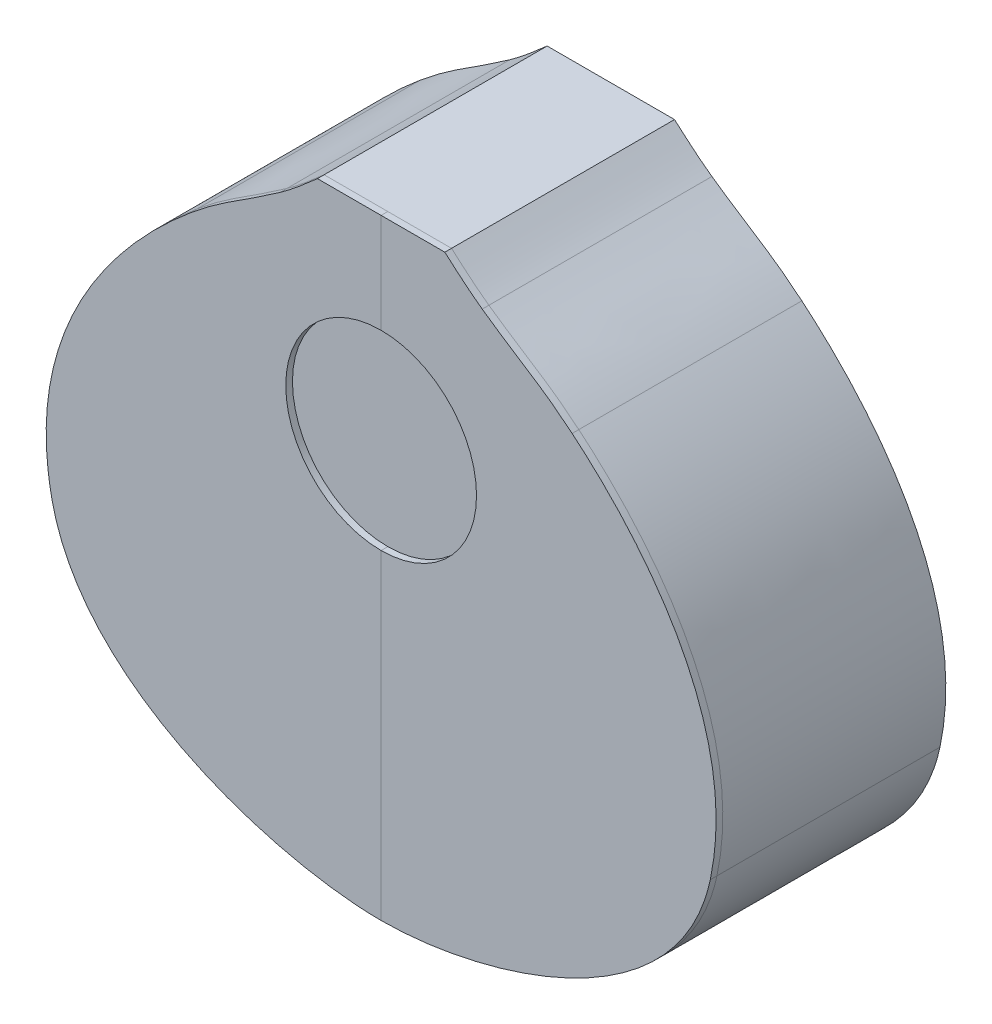
ISO-10303-21;
HEADER;
FILE_DESCRIPTION(('STEP AP214'),'2;1');
FILE_NAME('part.step','',(''),(''),'','','');
FILE_SCHEMA(('AUTOMOTIVE_DESIGN { 1 0 10303 214 1 1 1 1 }'));
ENDSEC;
DATA;
#1=APPLICATION_CONTEXT('core data for automotive mechanical design processes');
#2=APPLICATION_PROTOCOL_DEFINITION('international standard','automotive_design',2000,#1);
#3=PRODUCT_CONTEXT('',#1,'mechanical');
#4=PRODUCT('Part','Part','',(#3));
#5=PRODUCT_RELATED_PRODUCT_CATEGORY('part','',(#4));
#6=PRODUCT_DEFINITION_FORMATION('','',#4);
#7=PRODUCT_DEFINITION_CONTEXT('part definition',#1,'design');
#8=PRODUCT_DEFINITION('design','',#6,#7);
#9=PRODUCT_DEFINITION_SHAPE('','',#8);
#10=(LENGTH_UNIT() NAMED_UNIT(*) SI_UNIT(.MILLI.,.METRE.));
#11=(NAMED_UNIT(*) PLANE_ANGLE_UNIT() SI_UNIT($,.RADIAN.));
#12=(NAMED_UNIT(*) SI_UNIT($,.STERADIAN.) SOLID_ANGLE_UNIT());
#13=UNCERTAINTY_MEASURE_WITH_UNIT(LENGTH_MEASURE(1.E-05),#10,'distance_accuracy_value','');
#14=(GEOMETRIC_REPRESENTATION_CONTEXT(3) GLOBAL_UNCERTAINTY_ASSIGNED_CONTEXT((#13)) GLOBAL_UNIT_ASSIGNED_CONTEXT((#10,
#11,#12)) REPRESENTATION_CONTEXT('',''));
#15=CARTESIAN_POINT('',(0.,0.,0.));
#16=DIRECTION('',(0.,0.,1.));
#17=DIRECTION('',(1.,0.,0.));
#18=AXIS2_PLACEMENT_3D('',#15,#16,#17);
#19=CARTESIAN_POINT('',(28.5608026699999,136.916395712,103.));
#20=DIRECTION('',(0.,-1.,0.));
#21=DIRECTION('',(0.,0.,-1.));
#22=AXIS2_PLACEMENT_3D('',#19,#20,#21);
#23=PLANE('',#22);
#24=DIRECTION('',(-1.,0.,0.));
#25=VECTOR('',#24,1.);
#26=CARTESIAN_POINT('',(28.5608026699999,136.916395712,100.));
#27=LINE('',#26,#25);
#28=CARTESIAN_POINT('',(28.5608026699999,136.916395712,100.));
#29=VERTEX_POINT('',#28);
#30=CARTESIAN_POINT('',(2.54000051894132E-07,136.916395712,100.));
#31=VERTEX_POINT('',#30);
#32=EDGE_CURVE('E215',#29,#31,#27,.T.);
#33=ORIENTED_EDGE('',*,*,#32,.T.);
#34=DIRECTION('',(0.,0.,-1.));
#35=VECTOR('',#34,1.);
#36=CARTESIAN_POINT('',(2.54000051894132E-07,136.916395712,103.));
#37=LINE('',#36,#35);
#38=CARTESIAN_POINT('',(2.54000051894132E-07,136.916395712,103.));
#39=VERTEX_POINT('',#38);
#40=EDGE_CURVE('E12',#39,#31,#37,.T.);
#41=ORIENTED_EDGE('',*,*,#40,.F.);
#42=DIRECTION('',(-1.,0.,0.));
#43=VECTOR('',#42,1.);
#44=CARTESIAN_POINT('',(28.5608026699999,136.916395712,103.));
#45=LINE('',#44,#43);
#46=CARTESIAN_POINT('',(28.5608026699999,136.916395712,103.));
#47=VERTEX_POINT('',#46);
#48=EDGE_CURVE('E176',#47,#39,#45,.T.);
#49=ORIENTED_EDGE('',*,*,#48,.F.);
#50=DIRECTION('',(0.,0.,-1.));
#51=VECTOR('',#50,1.);
#52=CARTESIAN_POINT('',(28.5608026699999,136.916395712,103.));
#53=LINE('',#52,#51);
#54=EDGE_CURVE('E134',#47,#29,#53,.T.);
#55=ORIENTED_EDGE('',*,*,#54,.T.);
#56=EDGE_LOOP('',(#33,#41,#49,#55));
#57=FACE_BOUND('',#56,.T.);
#58=ADVANCED_FACE('F42',(#57),#23,.F.);
#59=CARTESIAN_POINT('',(2.54000051894132E-07,136.916395712,103.));
#60=DIRECTION('',(1.,0.,0.));
#61=DIRECTION('',(0.,0.,-1.));
#62=AXIS2_PLACEMENT_3D('',#59,#60,#61);
#63=PLANE('',#62);
#64=DIRECTION('',(0.,-1.,0.));
#65=VECTOR('',#64,1.);
#66=CARTESIAN_POINT('',(2.54000051894132E-07,136.916395712,100.));
#67=LINE('',#66,#65);
#68=CARTESIAN_POINT('',(2.54000051894132E-07,92.3065453022117,100.));
#69=VERTEX_POINT('',#68);
#70=EDGE_CURVE('E209',#31,#69,#67,.T.);
#71=ORIENTED_EDGE('',*,*,#70,.T.);
#72=DIRECTION('',(0.,0.,-1.));
#73=VECTOR('',#72,1.);
#74=CARTESIAN_POINT('',(2.54000051894132E-07,92.3065453022117,103.));
#75=LINE('',#74,#73);
#76=CARTESIAN_POINT('',(2.54000051894132E-07,92.3065453022117,103.));
#77=VERTEX_POINT('',#76);
#78=EDGE_CURVE('E50',#77,#69,#75,.T.);
#79=ORIENTED_EDGE('',*,*,#78,.F.);
#80=DIRECTION('',(0.,-1.,0.));
#81=VECTOR('',#80,1.);
#82=CARTESIAN_POINT('',(2.54000051894132E-07,136.916395712,103.));
#83=LINE('',#82,#81);
#84=EDGE_CURVE('E101',#39,#77,#83,.T.);
#85=ORIENTED_EDGE('',*,*,#84,.F.);
#86=ORIENTED_EDGE('',*,*,#40,.T.);
#87=EDGE_LOOP('',(#71,#79,#85,#86));
#88=FACE_BOUND('',#87,.T.);
#89=ADVANCED_FACE('F237',(#88),#63,.F.);
#90=CARTESIAN_POINT('',(2.54000051894132E-07,49.5382312132486,103.));
#91=DIRECTION('',(0.,0.,-1.));
#92=DIRECTION('',(-1.,0.,0.));
#93=AXIS2_PLACEMENT_3D('',#90,#91,#92);
#94=CYLINDRICAL_SURFACE('',#93,42.7683140889631);
#95=CARTESIAN_POINT('',(2.54000051894132E-07,49.5382312132486,100.));
#96=DIRECTION('',(0.,0.,-1.));
#97=DIRECTION('',(-1.,0.,0.));
#98=AXIS2_PLACEMENT_3D('',#95,#96,#97);
#99=CIRCLE('',#98,42.7683140889631);
#100=CARTESIAN_POINT('',(2.54000059750544E-07,6.76991712428546,100.));
#101=VERTEX_POINT('',#100);
#102=EDGE_CURVE('E204',#69,#101,#99,.T.);
#103=ORIENTED_EDGE('',*,*,#102,.T.);
#104=DIRECTION('',(0.,0.,-1.));
#105=VECTOR('',#104,1.);
#106=CARTESIAN_POINT('',(2.54000059750544E-07,6.76991712428546,103.));
#107=LINE('',#106,#105);
#108=CARTESIAN_POINT('',(2.54000059750544E-07,6.76991712428546,103.));
#109=VERTEX_POINT('',#108);
#110=EDGE_CURVE('E196',#109,#101,#107,.T.);
#111=ORIENTED_EDGE('',*,*,#110,.F.);
#112=CARTESIAN_POINT('',(2.54000051894132E-07,49.5382312132486,103.));
#113=DIRECTION('',(0.,0.,-1.));
#114=DIRECTION('',(-1.,0.,0.));
#115=AXIS2_PLACEMENT_3D('',#112,#113,#114);
#116=CIRCLE('',#115,42.7683140889631);
#117=EDGE_CURVE('E173',#77,#109,#116,.T.);
#118=ORIENTED_EDGE('',*,*,#117,.F.);
#119=ORIENTED_EDGE('',*,*,#78,.T.);
#120=EDGE_LOOP('',(#103,#111,#118,#119));
#121=FACE_BOUND('',#120,.T.);
#122=ADVANCED_FACE('F202',(#121),#94,.F.);
#123=CARTESIAN_POINT('',(2.54000051894132E-07,6.76991712428546,103.));
#124=DIRECTION('',(1.,0.,0.));
#125=DIRECTION('',(0.,1.,0.));
#126=AXIS2_PLACEMENT_3D('',#123,#124,#125);
#127=PLANE('',#126);
#128=DIRECTION('',(0.,-1.,0.));
#129=VECTOR('',#128,1.);
#130=CARTESIAN_POINT('',(2.54000051894132E-07,6.76991712428546,100.));
#131=LINE('',#130,#129);
#132=CARTESIAN_POINT('',(2.5399994087183E-07,-136.916395712,100.));
#133=VERTEX_POINT('',#132);
#134=EDGE_CURVE('E211',#101,#133,#131,.T.);
#135=ORIENTED_EDGE('',*,*,#134,.T.);
#136=DIRECTION('',(0.,0.,-1.));
#137=VECTOR('',#136,1.);
#138=CARTESIAN_POINT('',(2.5399994087183E-07,-136.916395712,103.));
#139=LINE('',#138,#137);
#140=CARTESIAN_POINT('',(2.5399994087183E-07,-136.916395712,103.));
#141=VERTEX_POINT('',#140);
#142=EDGE_CURVE('E193',#141,#133,#139,.T.);
#143=ORIENTED_EDGE('',*,*,#142,.F.);
#144=DIRECTION('',(0.,-1.,0.));
#145=VECTOR('',#144,1.);
#146=CARTESIAN_POINT('',(2.54000051894132E-07,6.76991712428546,103.));
#147=LINE('',#146,#145);
#148=EDGE_CURVE('E168',#109,#141,#147,.T.);
#149=ORIENTED_EDGE('',*,*,#148,.F.);
#150=ORIENTED_EDGE('',*,*,#110,.T.);
#151=EDGE_LOOP('',(#135,#143,#149,#150));
#152=FACE_BOUND('',#151,.T.);
#153=ADVANCED_FACE('F161',(#152),#127,.F.);
#154=CARTESIAN_POINT('',(2.54000051894132E-07,-136.916395712,103.));
#155=CARTESIAN_POINT('',(46.4413409500002,-136.916395601955,103.));
#156=CARTESIAN_POINT('',(133.833406898179,-111.670406770875,103.));
#157=CARTESIAN_POINT('',(147.578497873594,-47.2764964103053,103.));
#158=B_SPLINE_CURVE_WITH_KNOTS('',3,(#154,#155,#156,#157),.UNSPECIFIED.,.F.,.F.,(4,4),(0.,1.),.UNSPECIFIED.);
#159=DIRECTION('',(0.,0.,-1.));
#160=VECTOR('',#159,1.);
#161=SURFACE_OF_LINEAR_EXTRUSION('',#158,#160);
#162=CARTESIAN_POINT('',(2.54000051894132E-07,-136.916395712,100.));
#163=CARTESIAN_POINT('',(46.4413409500002,-136.916395601955,100.));
#164=CARTESIAN_POINT('',(133.833406898179,-111.670406770875,100.));
#165=CARTESIAN_POINT('',(147.578497873594,-47.2764964103053,100.));
#166=B_SPLINE_CURVE_WITH_KNOTS('',3,(#162,#163,#164,#165),.UNSPECIFIED.,.F.,.F.,(4,4),(0.,1.),.UNSPECIFIED.);
#167=CARTESIAN_POINT('',(147.578497873594,-47.2764964103053,100.));
#168=VERTEX_POINT('',#167);
#169=EDGE_CURVE('E213',#133,#168,#166,.T.);
#170=ORIENTED_EDGE('',*,*,#169,.T.);
#171=DIRECTION('',(0.,0.,-1.));
#172=VECTOR('',#171,1.);
#173=CARTESIAN_POINT('',(147.578497873594,-47.2764964103053,103.));
#174=LINE('',#173,#172);
#175=CARTESIAN_POINT('',(147.578497873594,-47.2764964103053,103.));
#176=VERTEX_POINT('',#175);
#177=EDGE_CURVE('E129',#176,#168,#174,.T.);
#178=ORIENTED_EDGE('',*,*,#177,.F.);
#179=EDGE_CURVE('E120',#141,#176,#158,.T.);
#180=ORIENTED_EDGE('',*,*,#179,.F.);
#181=ORIENTED_EDGE('',*,*,#142,.T.);
#182=EDGE_LOOP('',(#170,#178,#180,#181));
#183=FACE_BOUND('',#182,.T.);
#184=ADVANCED_FACE('F158',(#183),#161,.F.);
#185=CARTESIAN_POINT('',(147.578497873594,-47.2764964103053,103.));
#186=CARTESIAN_POINT('',(163.110193094786,25.4872575653832,103.));
#187=CARTESIAN_POINT('',(105.36071825103,78.5808853673423,103.));
#188=CARTESIAN_POINT('',(85.63939819,95.058759336,103.));
#189=B_SPLINE_CURVE_WITH_KNOTS('',3,(#185,#186,#187,#188),.UNSPECIFIED.,.F.,.F.,(4,4),(0.,1.),.UNSPECIFIED.);
#190=DIRECTION('',(0.,0.,-1.));
#191=VECTOR('',#190,1.);
#192=SURFACE_OF_LINEAR_EXTRUSION('',#189,#191);
#193=CARTESIAN_POINT('',(147.578497873594,-47.2764964103053,100.));
#194=CARTESIAN_POINT('',(163.110193094786,25.4872575653832,100.));
#195=CARTESIAN_POINT('',(105.36071825103,78.5808853673423,100.));
#196=CARTESIAN_POINT('',(85.63939819,95.058759336,100.));
#197=B_SPLINE_CURVE_WITH_KNOTS('',3,(#193,#194,#195,#196),.UNSPECIFIED.,.F.,.F.,(4,4),(0.,1.),.UNSPECIFIED.);
#198=CARTESIAN_POINT('',(85.63939819,95.058759336,100.));
#199=VERTEX_POINT('',#198);
#200=EDGE_CURVE('E128',#168,#199,#197,.T.);
#201=ORIENTED_EDGE('',*,*,#200,.T.);
#202=DIRECTION('',(0.,0.,-1.));
#203=VECTOR('',#202,1.);
#204=CARTESIAN_POINT('',(85.63939819,95.058759336,103.));
#205=LINE('',#204,#203);
#206=CARTESIAN_POINT('',(85.63939819,95.058759336,103.));
#207=VERTEX_POINT('',#206);
#208=EDGE_CURVE('E125',#207,#199,#205,.T.);
#209=ORIENTED_EDGE('',*,*,#208,.F.);
#210=EDGE_CURVE('E114',#176,#207,#189,.T.);
#211=ORIENTED_EDGE('',*,*,#210,.F.);
#212=ORIENTED_EDGE('',*,*,#177,.T.);
#213=EDGE_LOOP('',(#201,#209,#211,#212));
#214=FACE_BOUND('',#213,.T.);
#215=ADVANCED_FACE('F126',(#214),#192,.F.);
#216=CARTESIAN_POINT('',(85.63939819,95.058759336,103.));
#217=CARTESIAN_POINT('',(70.77869639,107.475422336,103.));
#218=CARTESIAN_POINT('',(62.7857664779999,110.83954464,103.));
#219=CARTESIAN_POINT('',(45.323206534,123.188624336,103.));
#220=B_SPLINE_CURVE_WITH_KNOTS('',3,(#216,#217,#218,#219),.UNSPECIFIED.,.F.,.F.,(4,4),(0.,1.),.UNSPECIFIED.);
#221=DIRECTION('',(0.,0.,-1.));
#222=VECTOR('',#221,1.);
#223=SURFACE_OF_LINEAR_EXTRUSION('',#220,#222);
#224=CARTESIAN_POINT('',(85.63939819,95.058759336,100.));
#225=CARTESIAN_POINT('',(70.77869639,107.475422336,100.));
#226=CARTESIAN_POINT('',(62.7857664779999,110.83954464,100.));
#227=CARTESIAN_POINT('',(45.323206534,123.188624336,100.));
#228=B_SPLINE_CURVE_WITH_KNOTS('',3,(#224,#225,#226,#227),.UNSPECIFIED.,.F.,.F.,(4,4),(0.,1.),.UNSPECIFIED.);
#229=CARTESIAN_POINT('',(45.323206534,123.188624336,100.));
#230=VERTEX_POINT('',#229);
#231=EDGE_CURVE('E87',#199,#230,#228,.T.);
#232=ORIENTED_EDGE('',*,*,#231,.T.);
#233=DIRECTION('',(0.,0.,-1.));
#234=VECTOR('',#233,1.);
#235=CARTESIAN_POINT('',(45.323206534,123.188624336,103.));
#236=LINE('',#235,#234);
#237=CARTESIAN_POINT('',(45.323206534,123.188624336,103.));
#238=VERTEX_POINT('',#237);
#239=EDGE_CURVE('E130',#238,#230,#236,.T.);
#240=ORIENTED_EDGE('',*,*,#239,.F.);
#241=EDGE_CURVE('E118',#207,#238,#220,.T.);
#242=ORIENTED_EDGE('',*,*,#241,.F.);
#243=ORIENTED_EDGE('',*,*,#208,.T.);
#244=EDGE_LOOP('',(#232,#240,#242,#243));
#245=FACE_BOUND('',#244,.T.);
#246=ADVANCED_FACE('F132',(#245),#223,.F.);
#247=CARTESIAN_POINT('',(45.323206534,123.188624336,103.));
#248=CARTESIAN_POINT('',(39.502343398,127.304974752,103.));
#249=CARTESIAN_POINT('',(33.933523446,132.194713512,103.));
#250=CARTESIAN_POINT('',(28.5608026699999,136.916395712,103.));
#251=B_SPLINE_CURVE_WITH_KNOTS('',3,(#247,#248,#249,#250),.UNSPECIFIED.,.F.,.F.,(4,4),(0.,1.),.UNSPECIFIED.);
#252=DIRECTION('',(0.,0.,-1.));
#253=VECTOR('',#252,1.);
#254=SURFACE_OF_LINEAR_EXTRUSION('',#251,#253);
#255=CARTESIAN_POINT('',(45.323206534,123.188624336,100.));
#256=CARTESIAN_POINT('',(39.502343398,127.304974752,100.));
#257=CARTESIAN_POINT('',(33.933523446,132.194713512,100.));
#258=CARTESIAN_POINT('',(28.5608026699999,136.916395712,100.));
#259=B_SPLINE_CURVE_WITH_KNOTS('',3,(#255,#256,#257,#258),.UNSPECIFIED.,.F.,.F.,(4,4),(0.,1.),.UNSPECIFIED.);
#260=EDGE_CURVE('E93',#230,#29,#259,.T.);
#261=ORIENTED_EDGE('',*,*,#260,.T.);
#262=ORIENTED_EDGE('',*,*,#54,.F.);
#263=EDGE_CURVE('E58',#238,#47,#251,.T.);
#264=ORIENTED_EDGE('',*,*,#263,.F.);
#265=ORIENTED_EDGE('',*,*,#239,.T.);
#266=EDGE_LOOP('',(#261,#262,#264,#265));
#267=FACE_BOUND('',#266,.T.);
#268=ADVANCED_FACE('F154',(#267),#254,.F.);
#269=CARTESIAN_POINT('',(2.54000051894132E-07,49.5382312132486,103.));
#270=DIRECTION('',(0.,0.,-1.));
#271=DIRECTION('',(-1.,0.,0.));
#272=AXIS2_PLACEMENT_3D('',#269,#270,#271);
#273=PLANE('',#272);
#274=ORIENTED_EDGE('',*,*,#48,.T.);
#275=ORIENTED_EDGE('',*,*,#84,.T.);
#276=ORIENTED_EDGE('',*,*,#117,.T.);
#277=ORIENTED_EDGE('',*,*,#148,.T.);
#278=ORIENTED_EDGE('',*,*,#179,.T.);
#279=ORIENTED_EDGE('',*,*,#210,.T.);
#280=ORIENTED_EDGE('',*,*,#241,.T.);
#281=ORIENTED_EDGE('',*,*,#263,.T.);
#282=EDGE_LOOP('',(#274,#275,#276,#277,#278,#279,#280,#281));
#283=FACE_BOUND('',#282,.T.);
#284=ADVANCED_FACE('F116',(#283),#273,.F.);
#285=CARTESIAN_POINT('',(2.54000051894132E-07,49.5382312132486,100.));
#286=DIRECTION('',(0.,0.,-1.));
#287=DIRECTION('',(-1.,0.,0.));
#288=AXIS2_PLACEMENT_3D('',#285,#286,#287);
#289=PLANE('',#288);
#290=ORIENTED_EDGE('',*,*,#32,.F.);
#291=ORIENTED_EDGE('',*,*,#260,.F.);
#292=ORIENTED_EDGE('',*,*,#231,.F.);
#293=ORIENTED_EDGE('',*,*,#200,.F.);
#294=ORIENTED_EDGE('',*,*,#169,.F.);
#295=ORIENTED_EDGE('',*,*,#134,.F.);
#296=ORIENTED_EDGE('',*,*,#102,.F.);
#297=ORIENTED_EDGE('',*,*,#70,.F.);
#298=EDGE_LOOP('',(#290,#291,#292,#293,#294,#295,#296,#297));
#299=FACE_BOUND('',#298,.T.);
#300=ADVANCED_FACE('F208',(#299),#289,.T.);
#301=CLOSED_SHELL('',(#58,#89,#122,#153,#184,#215,#246,#268,#284,#300));
#302=MANIFOLD_SOLID_BREP('B2',#301);
#303=CARTESIAN_POINT('',(-147.578497365594,-47.2764964103053,103.));
#304=CARTESIAN_POINT('',(-133.833406390178,-111.670406770875,103.));
#305=CARTESIAN_POINT('',(-46.441340442,-136.916395601955,103.));
#306=CARTESIAN_POINT('',(2.54000098731666E-07,-136.916395712,103.));
#307=B_SPLINE_CURVE_WITH_KNOTS('',3,(#303,#304,#305,#306),.UNSPECIFIED.,.F.,.F.,(4,4),(0.,1.),.UNSPECIFIED.);
#308=DIRECTION('',(0.,0.,-1.));
#309=VECTOR('',#308,1.);
#310=SURFACE_OF_LINEAR_EXTRUSION('',#307,#309);
#311=CARTESIAN_POINT('',(-147.578497365594,-47.2764964103053,100.));
#312=CARTESIAN_POINT('',(-133.833406390178,-111.670406770875,100.));
#313=CARTESIAN_POINT('',(-46.441340442,-136.916395601955,100.));
#314=CARTESIAN_POINT('',(2.54000098731666E-07,-136.916395712,100.));
#315=B_SPLINE_CURVE_WITH_KNOTS('',3,(#311,#312,#313,#314),.UNSPECIFIED.,.F.,.F.,(4,4),(0.,1.),.UNSPECIFIED.);
#316=CARTESIAN_POINT('',(-147.578497365594,-47.2764964103053,100.));
#317=VERTEX_POINT('',#316);
#318=CARTESIAN_POINT('',(2.53999987709363E-07,-136.916395712,100.));
#319=VERTEX_POINT('',#318);
#320=EDGE_CURVE('E466',#317,#319,#315,.T.);
#321=ORIENTED_EDGE('',*,*,#320,.T.);
#322=DIRECTION('',(0.,0.,-1.));
#323=VECTOR('',#322,1.);
#324=CARTESIAN_POINT('',(2.53999987709363E-07,-136.916395712,103.));
#325=LINE('',#324,#323);
#326=CARTESIAN_POINT('',(2.53999987709363E-07,-136.916395712,103.));
#327=VERTEX_POINT('',#326);
#328=EDGE_CURVE('E40',#327,#319,#325,.T.);
#329=ORIENTED_EDGE('',*,*,#328,.F.);
#330=CARTESIAN_POINT('',(-147.578497365594,-47.2764964103053,103.));
#331=VERTEX_POINT('',#330);
#332=EDGE_CURVE('E496',#331,#327,#307,.T.);
#333=ORIENTED_EDGE('',*,*,#332,.F.);
#334=DIRECTION('',(0.,0.,-1.));
#335=VECTOR('',#334,1.);
#336=CARTESIAN_POINT('',(-147.578497365594,-47.2764964103053,103.));
#337=LINE('',#336,#335);
#338=EDGE_CURVE('E416',#331,#317,#337,.T.);
#339=ORIENTED_EDGE('',*,*,#338,.T.);
#340=EDGE_LOOP('',(#321,#329,#333,#339));
#341=FACE_BOUND('',#340,.T.);
#342=ADVANCED_FACE('F323',(#341),#310,.F.);
#343=CARTESIAN_POINT('',(2.54000043220515E-07,6.76991712428551,103.));
#344=DIRECTION('',(-1.,0.,0.));
#345=DIRECTION('',(0.,-1.,0.));
#346=AXIS2_PLACEMENT_3D('',#343,#344,#345);
#347=PLANE('',#346);
#348=DIRECTION('',(0.,1.,0.));
#349=VECTOR('',#348,1.);
#350=CARTESIAN_POINT('',(2.54000043220515E-07,6.76991712428551,100.));
#351=LINE('',#350,#349);
#352=CARTESIAN_POINT('',(2.54000035364103E-07,6.76991712428551,100.));
#353=VERTEX_POINT('',#352);
#354=EDGE_CURVE('E457',#319,#353,#351,.T.);
#355=ORIENTED_EDGE('',*,*,#354,.T.);
#356=DIRECTION('',(0.,0.,-1.));
#357=VECTOR('',#356,1.);
#358=CARTESIAN_POINT('',(2.54000035364103E-07,6.76991712428551,103.));
#359=LINE('',#358,#357);
#360=CARTESIAN_POINT('',(2.54000035364103E-07,6.76991712428551,103.));
#361=VERTEX_POINT('',#360);
#362=EDGE_CURVE('E332',#361,#353,#359,.T.);
#363=ORIENTED_EDGE('',*,*,#362,.F.);
#364=DIRECTION('',(0.,1.,0.));
#365=VECTOR('',#364,1.);
#366=CARTESIAN_POINT('',(2.54000043220515E-07,6.76991712428551,103.));
#367=LINE('',#366,#365);
#368=EDGE_CURVE('E383',#327,#361,#367,.T.);
#369=ORIENTED_EDGE('',*,*,#368,.F.);
#370=ORIENTED_EDGE('',*,*,#328,.T.);
#371=EDGE_LOOP('',(#355,#363,#369,#370));
#372=FACE_BOUND('',#371,.T.);
#373=ADVANCED_FACE('F450',(#372),#347,.F.);
#374=CARTESIAN_POINT('',(2.54000043220515E-07,49.5382312132487,103.));
#375=DIRECTION('',(0.,0.,-1.));
#376=DIRECTION('',(-1.,0.,0.));
#377=AXIS2_PLACEMENT_3D('',#374,#375,#376);
#378=CYLINDRICAL_SURFACE('',#377,42.7683140889631);
#379=CARTESIAN_POINT('',(2.54000043220515E-07,49.5382312132487,100.));
#380=DIRECTION('',(0.,0.,-1.));
#381=DIRECTION('',(1.,0.,0.));
#382=AXIS2_PLACEMENT_3D('',#379,#380,#381);
#383=CIRCLE('',#382,42.7683140889631);
#384=CARTESIAN_POINT('',(2.5400007097609E-07,92.3065453022118,100.));
#385=VERTEX_POINT('',#384);
#386=EDGE_CURVE('E465',#353,#385,#383,.T.);
#387=ORIENTED_EDGE('',*,*,#386,.T.);
#388=DIRECTION('',(0.,0.,-1.));
#389=VECTOR('',#388,1.);
#390=CARTESIAN_POINT('',(2.5400007097609E-07,92.3065453022118,103.));
#391=LINE('',#390,#389);
#392=CARTESIAN_POINT('',(2.5400007097609E-07,92.3065453022118,103.));
#393=VERTEX_POINT('',#392);
#394=EDGE_CURVE('E471',#393,#385,#391,.T.);
#395=ORIENTED_EDGE('',*,*,#394,.F.);
#396=CARTESIAN_POINT('',(2.54000043220515E-07,49.5382312132487,103.));
#397=DIRECTION('',(0.,0.,-1.));
#398=DIRECTION('',(1.,0.,0.));
#399=AXIS2_PLACEMENT_3D('',#396,#397,#398);
#400=CIRCLE('',#399,42.7683140889631);
#401=EDGE_CURVE('E470',#361,#393,#400,.T.);
#402=ORIENTED_EDGE('',*,*,#401,.F.);
#403=ORIENTED_EDGE('',*,*,#362,.T.);
#404=EDGE_LOOP('',(#387,#395,#402,#403));
#405=FACE_BOUND('',#404,.T.);
#406=ADVANCED_FACE('F447',(#405),#378,.F.);
#407=CARTESIAN_POINT('',(2.54000043220515E-07,136.916395712,103.));
#408=DIRECTION('',(-1.,0.,0.));
#409=DIRECTION('',(0.,-1.,0.));
#410=AXIS2_PLACEMENT_3D('',#407,#408,#409);
#411=PLANE('',#410);
#412=DIRECTION('',(0.,1.,0.));
#413=VECTOR('',#412,1.);
#414=CARTESIAN_POINT('',(2.54000043220515E-07,136.916395712,100.));
#415=LINE('',#414,#413);
#416=CARTESIAN_POINT('',(2.54000043220515E-07,136.916395712,100.));
#417=VERTEX_POINT('',#416);
#418=EDGE_CURVE('E475',#385,#417,#415,.T.);
#419=ORIENTED_EDGE('',*,*,#418,.T.);
#420=DIRECTION('',(0.,0.,-1.));
#421=VECTOR('',#420,1.);
#422=CARTESIAN_POINT('',(2.54000043220515E-07,136.916395712,103.));
#423=LINE('',#422,#421);
#424=CARTESIAN_POINT('',(2.54000043220515E-07,136.916395712,103.));
#425=VERTEX_POINT('',#424);
#426=EDGE_CURVE('E503',#425,#417,#423,.T.);
#427=ORIENTED_EDGE('',*,*,#426,.F.);
#428=DIRECTION('',(0.,1.,0.));
#429=VECTOR('',#428,1.);
#430=CARTESIAN_POINT('',(2.54000043220515E-07,136.916395712,103.));
#431=LINE('',#430,#429);
#432=EDGE_CURVE('E508',#393,#425,#431,.T.);
#433=ORIENTED_EDGE('',*,*,#432,.F.);
#434=ORIENTED_EDGE('',*,*,#394,.T.);
#435=EDGE_LOOP('',(#419,#427,#433,#434));
#436=FACE_BOUND('',#435,.T.);
#437=ADVANCED_FACE('F443',(#436),#411,.F.);
#438=CARTESIAN_POINT('',(-28.5608021619999,136.916395712,103.));
#439=DIRECTION('',(0.,-1.,0.));
#440=DIRECTION('',(0.,0.,-1.));
#441=AXIS2_PLACEMENT_3D('',#438,#439,#440);
#442=PLANE('',#441);
#443=DIRECTION('',(-1.,0.,0.));
#444=VECTOR('',#443,1.);
#445=CARTESIAN_POINT('',(-28.5608021619999,136.916395712,100.));
#446=LINE('',#445,#444);
#447=CARTESIAN_POINT('',(-28.5608021619999,136.916395712,100.));
#448=VERTEX_POINT('',#447);
#449=EDGE_CURVE('E477',#417,#448,#446,.T.);
#450=ORIENTED_EDGE('',*,*,#449,.T.);
#451=DIRECTION('',(0.,0.,-1.));
#452=VECTOR('',#451,1.);
#453=CARTESIAN_POINT('',(-28.5608021619999,136.916395712,103.));
#454=LINE('',#453,#452);
#455=CARTESIAN_POINT('',(-28.5608021619999,136.916395712,103.));
#456=VERTEX_POINT('',#455);
#457=EDGE_CURVE('E411',#456,#448,#454,.T.);
#458=ORIENTED_EDGE('',*,*,#457,.F.);
#459=DIRECTION('',(-1.,0.,0.));
#460=VECTOR('',#459,1.);
#461=CARTESIAN_POINT('',(-28.5608021619999,136.916395712,103.));
#462=LINE('',#461,#460);
#463=EDGE_CURVE('E402',#425,#456,#462,.T.);
#464=ORIENTED_EDGE('',*,*,#463,.F.);
#465=ORIENTED_EDGE('',*,*,#426,.T.);
#466=EDGE_LOOP('',(#450,#458,#464,#465));
#467=FACE_BOUND('',#466,.T.);
#468=ADVANCED_FACE('F440',(#467),#442,.F.);
#469=CARTESIAN_POINT('',(-28.5608021619999,136.916395712,103.));
#470=CARTESIAN_POINT('',(-33.9335229379999,132.194713512,103.));
#471=CARTESIAN_POINT('',(-39.5023428899999,127.304974752,103.));
#472=CARTESIAN_POINT('',(-45.3232060259999,123.188624336,103.));
#473=B_SPLINE_CURVE_WITH_KNOTS('',3,(#469,#470,#471,#472),.UNSPECIFIED.,.F.,.F.,(4,4),(0.,1.),.UNSPECIFIED.);
#474=DIRECTION('',(0.,0.,-1.));
#475=VECTOR('',#474,1.);
#476=SURFACE_OF_LINEAR_EXTRUSION('',#473,#475);
#477=CARTESIAN_POINT('',(-28.5608021619999,136.916395712,100.));
#478=CARTESIAN_POINT('',(-33.9335229379999,132.194713512,100.));
#479=CARTESIAN_POINT('',(-39.5023428899999,127.304974752,100.));
#480=CARTESIAN_POINT('',(-45.3232060259999,123.188624336,100.));
#481=B_SPLINE_CURVE_WITH_KNOTS('',3,(#477,#478,#479,#480),.UNSPECIFIED.,.F.,.F.,(4,4),(0.,1.),.UNSPECIFIED.);
#482=CARTESIAN_POINT('',(-45.3232060259999,123.188624336,100.));
#483=VERTEX_POINT('',#482);
#484=EDGE_CURVE('E410',#448,#483,#481,.T.);
#485=ORIENTED_EDGE('',*,*,#484,.T.);
#486=DIRECTION('',(0.,0.,-1.));
#487=VECTOR('',#486,1.);
#488=CARTESIAN_POINT('',(-45.3232060259999,123.188624336,103.));
#489=LINE('',#488,#487);
#490=CARTESIAN_POINT('',(-45.3232060259999,123.188624336,103.));
#491=VERTEX_POINT('',#490);
#492=EDGE_CURVE('E407',#491,#483,#489,.T.);
#493=ORIENTED_EDGE('',*,*,#492,.F.);
#494=EDGE_CURVE('E396',#456,#491,#473,.T.);
#495=ORIENTED_EDGE('',*,*,#494,.F.);
#496=ORIENTED_EDGE('',*,*,#457,.T.);
#497=EDGE_LOOP('',(#485,#493,#495,#496));
#498=FACE_BOUND('',#497,.T.);
#499=ADVANCED_FACE('F408',(#498),#476,.F.);
#500=CARTESIAN_POINT('',(-45.3232060259999,123.188624336,103.));
#501=CARTESIAN_POINT('',(-62.7857659699999,110.83954464,103.));
#502=CARTESIAN_POINT('',(-70.7786958819999,107.475422336,103.));
#503=CARTESIAN_POINT('',(-85.6393976819999,95.0587593360001,103.));
#504=B_SPLINE_CURVE_WITH_KNOTS('',3,(#500,#501,#502,#503),.UNSPECIFIED.,.F.,.F.,(4,4),(0.,1.),.UNSPECIFIED.);
#505=DIRECTION('',(0.,0.,-1.));
#506=VECTOR('',#505,1.);
#507=SURFACE_OF_LINEAR_EXTRUSION('',#504,#506);
#508=CARTESIAN_POINT('',(-45.3232060259999,123.188624336,100.));
#509=CARTESIAN_POINT('',(-62.7857659699999,110.83954464,100.));
#510=CARTESIAN_POINT('',(-70.7786958819999,107.475422336,100.));
#511=CARTESIAN_POINT('',(-85.6393976819999,95.0587593360001,100.));
#512=B_SPLINE_CURVE_WITH_KNOTS('',3,(#508,#509,#510,#511),.UNSPECIFIED.,.F.,.F.,(4,4),(0.,1.),.UNSPECIFIED.);
#513=CARTESIAN_POINT('',(-85.6393976819999,95.0587593360001,100.));
#514=VERTEX_POINT('',#513);
#515=EDGE_CURVE('E369',#483,#514,#512,.T.);
#516=ORIENTED_EDGE('',*,*,#515,.T.);
#517=DIRECTION('',(0.,0.,-1.));
#518=VECTOR('',#517,1.);
#519=CARTESIAN_POINT('',(-85.6393976819999,95.0587593360001,103.));
#520=LINE('',#519,#518);
#521=CARTESIAN_POINT('',(-85.6393976819999,95.0587593360001,103.));
#522=VERTEX_POINT('',#521);
#523=EDGE_CURVE('E412',#522,#514,#520,.T.);
#524=ORIENTED_EDGE('',*,*,#523,.F.);
#525=EDGE_CURVE('E400',#491,#522,#504,.T.);
#526=ORIENTED_EDGE('',*,*,#525,.F.);
#527=ORIENTED_EDGE('',*,*,#492,.T.);
#528=EDGE_LOOP('',(#516,#524,#526,#527));
#529=FACE_BOUND('',#528,.T.);
#530=ADVANCED_FACE('F414',(#529),#507,.F.);
#531=CARTESIAN_POINT('',(-85.6393976819999,95.0587593360001,103.));
#532=CARTESIAN_POINT('',(-105.36071774303,78.5808853673423,103.));
#533=CARTESIAN_POINT('',(-163.110192586785,25.4872575653832,103.));
#534=CARTESIAN_POINT('',(-147.578497365594,-47.2764964103053,103.));
#535=B_SPLINE_CURVE_WITH_KNOTS('',3,(#531,#532,#533,#534),.UNSPECIFIED.,.F.,.F.,(4,4),(0.,1.),.UNSPECIFIED.);
#536=DIRECTION('',(0.,0.,-1.));
#537=VECTOR('',#536,1.);
#538=SURFACE_OF_LINEAR_EXTRUSION('',#535,#537);
#539=CARTESIAN_POINT('',(-85.6393976819999,95.0587593360001,100.));
#540=CARTESIAN_POINT('',(-105.36071774303,78.5808853673423,100.));
#541=CARTESIAN_POINT('',(-163.110192586785,25.4872575653832,100.));
#542=CARTESIAN_POINT('',(-147.578497365594,-47.2764964103053,100.));
#543=B_SPLINE_CURVE_WITH_KNOTS('',3,(#539,#540,#541,#542),.UNSPECIFIED.,.F.,.F.,(4,4),(0.,1.),.UNSPECIFIED.);
#544=EDGE_CURVE('E375',#514,#317,#543,.T.);
#545=ORIENTED_EDGE('',*,*,#544,.T.);
#546=ORIENTED_EDGE('',*,*,#338,.F.);
#547=EDGE_CURVE('E340',#522,#331,#535,.T.);
#548=ORIENTED_EDGE('',*,*,#547,.F.);
#549=ORIENTED_EDGE('',*,*,#523,.T.);
#550=EDGE_LOOP('',(#545,#546,#548,#549));
#551=FACE_BOUND('',#550,.T.);
#552=ADVANCED_FACE('F436',(#551),#538,.F.);
#553=CARTESIAN_POINT('',(-86.0503422010161,-116.244162405099,103.));
#554=DIRECTION('',(0.,0.,1.));
#555=DIRECTION('',(1.,0.,0.));
#556=AXIS2_PLACEMENT_3D('',#553,#554,#555);
#557=PLANE('',#556);
#558=ORIENTED_EDGE('',*,*,#332,.T.);
#559=ORIENTED_EDGE('',*,*,#368,.T.);
#560=ORIENTED_EDGE('',*,*,#401,.T.);
#561=ORIENTED_EDGE('',*,*,#432,.T.);
#562=ORIENTED_EDGE('',*,*,#463,.T.);
#563=ORIENTED_EDGE('',*,*,#494,.T.);
#564=ORIENTED_EDGE('',*,*,#525,.T.);
#565=ORIENTED_EDGE('',*,*,#547,.T.);
#566=EDGE_LOOP('',(#558,#559,#560,#561,#562,#563,#564,#565));
#567=FACE_BOUND('',#566,.T.);
#568=ADVANCED_FACE('F398',(#567),#557,.T.);
#569=CARTESIAN_POINT('',(-86.0503422010161,-116.244162405099,100.));
#570=DIRECTION('',(0.,0.,1.));
#571=DIRECTION('',(1.,0.,0.));
#572=AXIS2_PLACEMENT_3D('',#569,#570,#571);
#573=PLANE('',#572);
#574=ORIENTED_EDGE('',*,*,#320,.F.);
#575=ORIENTED_EDGE('',*,*,#544,.F.);
#576=ORIENTED_EDGE('',*,*,#515,.F.);
#577=ORIENTED_EDGE('',*,*,#484,.F.);
#578=ORIENTED_EDGE('',*,*,#449,.F.);
#579=ORIENTED_EDGE('',*,*,#418,.F.);
#580=ORIENTED_EDGE('',*,*,#386,.F.);
#581=ORIENTED_EDGE('',*,*,#354,.F.);
#582=EDGE_LOOP('',(#574,#575,#576,#577,#578,#579,#580,#581));
#583=FACE_BOUND('',#582,.T.);
#584=ADVANCED_FACE('F473',(#583),#573,.F.);
#585=CLOSED_SHELL('',(#342,#373,#406,#437,#468,#499,#530,#552,#568,#584));
#586=MANIFOLD_SOLID_BREP('B6',#585);
#587=CARTESIAN_POINT('',(-147.578497365594,-47.2764964103054,100.));
#588=CARTESIAN_POINT('',(-133.833406390178,-111.670406770875,100.));
#589=CARTESIAN_POINT('',(-46.441340442,-136.916395601955,100.));
#590=CARTESIAN_POINT('',(2.54000087163701E-07,-136.916395712,100.));
#591=B_SPLINE_CURVE_WITH_KNOTS('',3,(#587,#588,#589,#590),.UNSPECIFIED.,.F.,.F.,(4,4),(0.,1.),.UNSPECIFIED.);
#592=DIRECTION('',(0.,0.,-1.));
#593=VECTOR('',#592,1.);
#594=SURFACE_OF_LINEAR_EXTRUSION('',#591,#593);
#595=CARTESIAN_POINT('',(-147.578497365594,-47.2764964103054,0.));
#596=CARTESIAN_POINT('',(-133.833406390178,-111.670406770875,0.));
#597=CARTESIAN_POINT('',(-46.441340442,-136.916395601955,0.));
#598=CARTESIAN_POINT('',(2.54000087163701E-07,-136.916395712,0.));
#599=B_SPLINE_CURVE_WITH_KNOTS('',3,(#595,#596,#597,#598),.UNSPECIFIED.,.F.,.F.,(4,4),(0.,1.),.UNSPECIFIED.);
#600=CARTESIAN_POINT('',(-147.578497365594,-47.2764964103054,0.));
#601=VERTEX_POINT('',#600);
#602=CARTESIAN_POINT('',(2.53999985488917E-07,-136.916395712,0.));
#603=VERTEX_POINT('',#602);
#604=EDGE_CURVE('E713',#601,#603,#599,.T.);
#605=ORIENTED_EDGE('',*,*,#604,.T.);
#606=DIRECTION('',(0.,0.,-1.));
#607=VECTOR('',#606,1.);
#608=CARTESIAN_POINT('',(2.53999985488917E-07,-136.916395712,100.));
#609=LINE('',#608,#607);
#610=CARTESIAN_POINT('',(2.53999985488917E-07,-136.916395712,100.));
#611=VERTEX_POINT('',#610);
#612=EDGE_CURVE('E321',#611,#603,#609,.T.);
#613=ORIENTED_EDGE('',*,*,#612,.F.);
#614=CARTESIAN_POINT('',(-147.578497365594,-47.2764964103054,100.));
#615=VERTEX_POINT('',#614);
#616=EDGE_CURVE('E645',#615,#611,#591,.T.);
#617=ORIENTED_EDGE('',*,*,#616,.F.);
#618=DIRECTION('',(0.,0.,-1.));
#619=VECTOR('',#618,1.);
#620=CARTESIAN_POINT('',(-147.578497365594,-47.2764964103054,100.));
#621=LINE('',#620,#619);
#622=EDGE_CURVE('E674',#615,#601,#621,.T.);
#623=ORIENTED_EDGE('',*,*,#622,.T.);
#624=EDGE_LOOP('',(#605,#613,#617,#623));
#625=FACE_BOUND('',#624,.T.);
#626=ADVANCED_FACE('F595',(#625),#594,.F.);
#627=CARTESIAN_POINT('',(-28.5608021619999,136.916395712,100.));
#628=DIRECTION('',(0.,-1.,0.));
#629=DIRECTION('',(0.,0.,-1.));
#630=AXIS2_PLACEMENT_3D('',#627,#628,#629);
#631=PLANE('',#630);
#632=DIRECTION('',(-1.,0.,0.));
#633=VECTOR('',#632,1.);
#634=CARTESIAN_POINT('',(-28.5608021619999,136.916395712,0.));
#635=LINE('',#634,#633);
#636=CARTESIAN_POINT('',(28.56080267,136.916395712,0.));
#637=VERTEX_POINT('',#636);
#638=CARTESIAN_POINT('',(-28.5608021619999,136.916395712,0.));
#639=VERTEX_POINT('',#638);
#640=EDGE_CURVE('E706',#637,#639,#635,.T.);
#641=ORIENTED_EDGE('',*,*,#640,.T.);
#642=DIRECTION('',(0.,0.,-1.));
#643=VECTOR('',#642,1.);
#644=CARTESIAN_POINT('',(-28.5608021619999,136.916395712,100.));
#645=LINE('',#644,#643);
#646=CARTESIAN_POINT('',(-28.5608021619999,136.916395712,100.));
#647=VERTEX_POINT('',#646);
#648=EDGE_CURVE('E604',#647,#639,#645,.T.);
#649=ORIENTED_EDGE('',*,*,#648,.F.);
#650=DIRECTION('',(-1.,0.,0.));
#651=VECTOR('',#650,1.);
#652=CARTESIAN_POINT('',(-28.5608021619999,136.916395712,100.));
#653=LINE('',#652,#651);
#654=CARTESIAN_POINT('',(28.56080267,136.916395712,100.));
#655=VERTEX_POINT('',#654);
#656=EDGE_CURVE('E661',#655,#647,#653,.T.);
#657=ORIENTED_EDGE('',*,*,#656,.F.);
#658=DIRECTION('',(0.,0.,-1.));
#659=VECTOR('',#658,1.);
#660=CARTESIAN_POINT('',(28.56080267,136.916395712,100.));
#661=LINE('',#660,#659);
#662=EDGE_CURVE('E709',#655,#637,#661,.T.);
#663=ORIENTED_EDGE('',*,*,#662,.T.);
#664=EDGE_LOOP('',(#641,#649,#657,#663));
#665=FACE_BOUND('',#664,.T.);
#666=ADVANCED_FACE('F697',(#665),#631,.F.);
#667=CARTESIAN_POINT('',(-28.5608021619999,136.916395712,100.));
#668=CARTESIAN_POINT('',(-33.9335229379999,132.194713512,100.));
#669=CARTESIAN_POINT('',(-39.5023428899999,127.304974752,100.));
#670=CARTESIAN_POINT('',(-45.3232060259999,123.188624336,100.));
#671=B_SPLINE_CURVE_WITH_KNOTS('',3,(#667,#668,#669,#670),.UNSPECIFIED.,.F.,.F.,(4,4),(0.,1.),.UNSPECIFIED.);
#672=DIRECTION('',(0.,0.,-1.));
#673=VECTOR('',#672,1.);
#674=SURFACE_OF_LINEAR_EXTRUSION('',#671,#673);
#675=CARTESIAN_POINT('',(-28.5608021619999,136.916395712,0.));
#676=CARTESIAN_POINT('',(-33.9335229379999,132.194713512,0.));
#677=CARTESIAN_POINT('',(-39.5023428899999,127.304974752,0.));
#678=CARTESIAN_POINT('',(-45.3232060259999,123.188624336,0.));
#679=B_SPLINE_CURVE_WITH_KNOTS('',3,(#675,#676,#677,#678),.UNSPECIFIED.,.F.,.F.,(4,4),(0.,1.),.UNSPECIFIED.);
#680=CARTESIAN_POINT('',(-45.3232060259999,123.188624336,0.));
#681=VERTEX_POINT('',#680);
#682=EDGE_CURVE('E669',#639,#681,#679,.T.);
#683=ORIENTED_EDGE('',*,*,#682,.T.);
#684=DIRECTION('',(0.,0.,-1.));
#685=VECTOR('',#684,1.);
#686=CARTESIAN_POINT('',(-45.3232060259999,123.188624336,100.));
#687=LINE('',#686,#685);
#688=CARTESIAN_POINT('',(-45.3232060259999,123.188624336,100.));
#689=VERTEX_POINT('',#688);
#690=EDGE_CURVE('E666',#689,#681,#687,.T.);
#691=ORIENTED_EDGE('',*,*,#690,.F.);
#692=EDGE_CURVE('E654',#647,#689,#671,.T.);
#693=ORIENTED_EDGE('',*,*,#692,.F.);
#694=ORIENTED_EDGE('',*,*,#648,.T.);
#695=EDGE_LOOP('',(#683,#691,#693,#694));
#696=FACE_BOUND('',#695,.T.);
#697=ADVANCED_FACE('F667',(#696),#674,.F.);
#698=CARTESIAN_POINT('',(-45.3232060259999,123.188624336,100.));
#699=CARTESIAN_POINT('',(-62.7857659699999,110.83954464,100.));
#700=CARTESIAN_POINT('',(-70.7786958819999,107.475422336,100.));
#701=CARTESIAN_POINT('',(-85.6393976819999,95.058759336,100.));
#702=B_SPLINE_CURVE_WITH_KNOTS('',3,(#698,#699,#700,#701),.UNSPECIFIED.,.F.,.F.,(4,4),(0.,1.),.UNSPECIFIED.);
#703=DIRECTION('',(0.,0.,-1.));
#704=VECTOR('',#703,1.);
#705=SURFACE_OF_LINEAR_EXTRUSION('',#702,#704);
#706=CARTESIAN_POINT('',(-45.3232060259999,123.188624336,0.));
#707=CARTESIAN_POINT('',(-62.7857659699999,110.83954464,0.));
#708=CARTESIAN_POINT('',(-70.7786958819999,107.475422336,0.));
#709=CARTESIAN_POINT('',(-85.6393976819999,95.058759336,0.));
#710=B_SPLINE_CURVE_WITH_KNOTS('',3,(#706,#707,#708,#709),.UNSPECIFIED.,.F.,.F.,(4,4),(0.,1.),.UNSPECIFIED.);
#711=CARTESIAN_POINT('',(-85.6393976819999,95.058759336,0.));
#712=VERTEX_POINT('',#711);
#713=EDGE_CURVE('E633',#681,#712,#710,.T.);
#714=ORIENTED_EDGE('',*,*,#713,.T.);
#715=DIRECTION('',(0.,0.,-1.));
#716=VECTOR('',#715,1.);
#717=CARTESIAN_POINT('',(-85.6393976819999,95.058759336,100.));
#718=LINE('',#717,#716);
#719=CARTESIAN_POINT('',(-85.6393976819999,95.058759336,100.));
#720=VERTEX_POINT('',#719);
#721=EDGE_CURVE('E670',#720,#712,#718,.T.);
#722=ORIENTED_EDGE('',*,*,#721,.F.);
#723=EDGE_CURVE('E658',#689,#720,#702,.T.);
#724=ORIENTED_EDGE('',*,*,#723,.F.);
#725=ORIENTED_EDGE('',*,*,#690,.T.);
#726=EDGE_LOOP('',(#714,#722,#724,#725));
#727=FACE_BOUND('',#726,.T.);
#728=ADVANCED_FACE('F672',(#727),#705,.F.);
#729=CARTESIAN_POINT('',(-85.6393976819999,95.058759336,100.));
#730=CARTESIAN_POINT('',(-105.36071774303,78.5808853673423,100.));
#731=CARTESIAN_POINT('',(-163.110192586785,25.4872575653832,100.));
#732=CARTESIAN_POINT('',(-147.578497365594,-47.2764964103054,100.));
#733=B_SPLINE_CURVE_WITH_KNOTS('',3,(#729,#730,#731,#732),.UNSPECIFIED.,.F.,.F.,(4,4),(0.,1.),.UNSPECIFIED.);
#734=DIRECTION('',(0.,0.,-1.));
#735=VECTOR('',#734,1.);
#736=SURFACE_OF_LINEAR_EXTRUSION('',#733,#735);
#737=CARTESIAN_POINT('',(-85.6393976819999,95.058759336,0.));
#738=CARTESIAN_POINT('',(-105.36071774303,78.5808853673423,0.));
#739=CARTESIAN_POINT('',(-163.110192586785,25.4872575653832,0.));
#740=CARTESIAN_POINT('',(-147.578497365594,-47.2764964103054,0.));
#741=B_SPLINE_CURVE_WITH_KNOTS('',3,(#737,#738,#739,#740),.UNSPECIFIED.,.F.,.F.,(4,4),(0.,1.),.UNSPECIFIED.);
#742=EDGE_CURVE('E639',#712,#601,#741,.T.);
#743=ORIENTED_EDGE('',*,*,#742,.T.);
#744=ORIENTED_EDGE('',*,*,#622,.F.);
#745=EDGE_CURVE('E612',#720,#615,#733,.T.);
#746=ORIENTED_EDGE('',*,*,#745,.F.);
#747=ORIENTED_EDGE('',*,*,#721,.T.);
#748=EDGE_LOOP('',(#743,#744,#746,#747));
#749=FACE_BOUND('',#748,.T.);
#750=ADVANCED_FACE('F694',(#749),#736,.F.);
#751=CARTESIAN_POINT('',(-86.0503422010161,-116.244162405099,100.));
#752=DIRECTION('',(0.,0.,1.));
#753=DIRECTION('',(1.,0.,0.));
#754=AXIS2_PLACEMENT_3D('',#751,#752,#753);
#755=PLANE('',#754);
#756=ORIENTED_EDGE('',*,*,#616,.T.);
#757=CARTESIAN_POINT('',(0.,-136.916395712,100.));
#758=CARTESIAN_POINT('',(46.4413406959999,-136.916395629466,100.));
#759=CARTESIAN_POINT('',(133.833406659134,-111.670406850156,100.));
#760=CARTESIAN_POINT('',(147.578497672695,-47.2764964977289,100.));
#761=B_SPLINE_CURVE_WITH_KNOTS('',3,(#757,#758,#759,#760),.UNSPECIFIED.,.F.,.F.,(4,4),(0.,1.),.UNSPECIFIED.);
#762=CARTESIAN_POINT('',(147.578497672695,-47.2764964977289,100.));
#763=VERTEX_POINT('',#762);
#764=EDGE_CURVE('E769',#611,#763,#761,.T.);
#765=ORIENTED_EDGE('',*,*,#764,.T.);
#766=CARTESIAN_POINT('',(147.578497672695,-47.2764964977289,100.));
#767=CARTESIAN_POINT('',(163.110192996589,25.4872574560373,100.));
#768=CARTESIAN_POINT('',(105.360718227773,78.5808853395067,100.));
#769=CARTESIAN_POINT('',(85.63939819,95.058759336,100.));
#770=B_SPLINE_CURVE_WITH_KNOTS('',3,(#766,#767,#768,#769),.UNSPECIFIED.,.F.,.F.,(4,4),(0.,1.),.UNSPECIFIED.);
#771=CARTESIAN_POINT('',(85.63939819,95.058759336,100.));
#772=VERTEX_POINT('',#771);
#773=EDGE_CURVE('E773',#763,#772,#770,.T.);
#774=ORIENTED_EDGE('',*,*,#773,.T.);
#775=CARTESIAN_POINT('',(85.63939819,95.058759336,100.));
#776=CARTESIAN_POINT('',(70.77869639,107.475422336,100.));
#777=CARTESIAN_POINT('',(62.785766478,110.83954464,100.));
#778=CARTESIAN_POINT('',(45.323206534,123.188624336,100.));
#779=B_SPLINE_CURVE_WITH_KNOTS('',3,(#775,#776,#777,#778),.UNSPECIFIED.,.F.,.F.,(4,4),(0.,1.),.UNSPECIFIED.);
#780=CARTESIAN_POINT('',(45.323206534,123.188624336,100.));
#781=VERTEX_POINT('',#780);
#782=EDGE_CURVE('E825',#772,#781,#779,.T.);
#783=ORIENTED_EDGE('',*,*,#782,.T.);
#784=CARTESIAN_POINT('',(45.323206534,123.188624336,100.));
#785=CARTESIAN_POINT('',(39.502343398,127.304974752,100.));
#786=CARTESIAN_POINT('',(33.933523446,132.194713512,100.));
#787=CARTESIAN_POINT('',(28.56080267,136.916395712,100.));
#788=B_SPLINE_CURVE_WITH_KNOTS('',3,(#784,#785,#786,#787),.UNSPECIFIED.,.F.,.F.,(4,4),(0.,1.),.UNSPECIFIED.);
#789=EDGE_CURVE('E802',#781,#655,#788,.T.);
#790=ORIENTED_EDGE('',*,*,#789,.T.);
#791=ORIENTED_EDGE('',*,*,#656,.T.);
#792=ORIENTED_EDGE('',*,*,#692,.T.);
#793=ORIENTED_EDGE('',*,*,#723,.T.);
#794=ORIENTED_EDGE('',*,*,#745,.T.);
#795=EDGE_LOOP('',(#756,#765,#774,#783,#790,#791,#792,#793,#794));
#796=FACE_BOUND('',#795,.T.);
#797=ADVANCED_FACE('F656',(#796),#755,.T.);
#798=CARTESIAN_POINT('',(-86.0503422010161,-116.244162405099,0.));
#799=DIRECTION('',(0.,0.,1.));
#800=DIRECTION('',(1.,0.,0.));
#801=AXIS2_PLACEMENT_3D('',#798,#799,#800);
#802=PLANE('',#801);
#803=ORIENTED_EDGE('',*,*,#604,.F.);
#804=ORIENTED_EDGE('',*,*,#742,.F.);
#805=ORIENTED_EDGE('',*,*,#713,.F.);
#806=ORIENTED_EDGE('',*,*,#682,.F.);
#807=ORIENTED_EDGE('',*,*,#640,.F.);
#808=CARTESIAN_POINT('',(45.323206534,123.188624336,0.));
#809=CARTESIAN_POINT('',(39.502343398,127.304974752,0.));
#810=CARTESIAN_POINT('',(33.933523446,132.194713512,0.));
#811=CARTESIAN_POINT('',(28.56080267,136.916395712,0.));
#812=B_SPLINE_CURVE_WITH_KNOTS('',3,(#808,#809,#810,#811),.UNSPECIFIED.,.F.,.F.,(4,4),(0.,1.),.UNSPECIFIED.);
#813=CARTESIAN_POINT('',(45.323206534,123.188624336,0.));
#814=VERTEX_POINT('',#813);
#815=EDGE_CURVE('E774',#814,#637,#812,.T.);
#816=ORIENTED_EDGE('',*,*,#815,.F.);
#817=CARTESIAN_POINT('',(85.63939819,95.058759336,0.));
#818=CARTESIAN_POINT('',(70.77869639,107.475422336,0.));
#819=CARTESIAN_POINT('',(62.785766478,110.83954464,0.));
#820=CARTESIAN_POINT('',(45.323206534,123.188624336,0.));
#821=B_SPLINE_CURVE_WITH_KNOTS('',3,(#817,#818,#819,#820),.UNSPECIFIED.,.F.,.F.,(4,4),(0.,1.),.UNSPECIFIED.);
#822=CARTESIAN_POINT('',(85.63939819,95.058759336,0.));
#823=VERTEX_POINT('',#822);
#824=EDGE_CURVE('E781',#823,#814,#821,.T.);
#825=ORIENTED_EDGE('',*,*,#824,.F.);
#826=CARTESIAN_POINT('',(147.578497672695,-47.2764964977289,0.));
#827=CARTESIAN_POINT('',(163.110192996589,25.4872574560373,0.));
#828=CARTESIAN_POINT('',(105.360718227773,78.5808853395067,0.));
#829=CARTESIAN_POINT('',(85.63939819,95.058759336,0.));
#830=B_SPLINE_CURVE_WITH_KNOTS('',3,(#826,#827,#828,#829),.UNSPECIFIED.,.F.,.F.,(4,4),(0.,1.),.UNSPECIFIED.);
#831=CARTESIAN_POINT('',(147.578497672695,-47.2764964977289,0.));
#832=VERTEX_POINT('',#831);
#833=EDGE_CURVE('E788',#832,#823,#830,.T.);
#834=ORIENTED_EDGE('',*,*,#833,.F.);
#835=CARTESIAN_POINT('',(0.,-136.916395712,0.));
#836=CARTESIAN_POINT('',(46.4413406959999,-136.916395629466,0.));
#837=CARTESIAN_POINT('',(133.833406659134,-111.670406850156,0.));
#838=CARTESIAN_POINT('',(147.578497672695,-47.2764964977289,0.));
#839=B_SPLINE_CURVE_WITH_KNOTS('',3,(#835,#836,#837,#838),.UNSPECIFIED.,.F.,.F.,(4,4),(0.,1.),.UNSPECIFIED.);
#840=EDGE_CURVE('E740',#603,#832,#839,.T.);
#841=ORIENTED_EDGE('',*,*,#840,.F.);
#842=EDGE_LOOP('',(#803,#804,#805,#806,#807,#816,#825,#834,#841));
#843=FACE_BOUND('',#842,.T.);
#844=ADVANCED_FACE('F716',(#843),#802,.F.);
#845=DIRECTION('',(0.,0.,-1.));
#846=VECTOR('',#845,1.);
#847=SURFACE_OF_LINEAR_EXTRUSION('',#770,#846);
#848=ORIENTED_EDGE('',*,*,#833,.T.);
#849=DIRECTION('',(0.,0.,-1.));
#850=VECTOR('',#849,1.);
#851=CARTESIAN_POINT('',(85.63939819,95.058759336,100.));
#852=LINE('',#851,#850);
#853=EDGE_CURVE('E741',#772,#823,#852,.T.);
#854=ORIENTED_EDGE('',*,*,#853,.F.);
#855=ORIENTED_EDGE('',*,*,#773,.F.);
#856=DIRECTION('',(0.,0.,-1.));
#857=VECTOR('',#856,1.);
#858=CARTESIAN_POINT('',(147.578497672695,-47.2764964977289,100.));
#859=LINE('',#858,#857);
#860=EDGE_CURVE('E766',#763,#832,#859,.T.);
#861=ORIENTED_EDGE('',*,*,#860,.T.);
#862=EDGE_LOOP('',(#848,#854,#855,#861));
#863=FACE_BOUND('',#862,.T.);
#864=ADVANCED_FACE('F822',(#863),#847,.F.);
#865=DIRECTION('',(0.,0.,-1.));
#866=VECTOR('',#865,1.);
#867=SURFACE_OF_LINEAR_EXTRUSION('',#779,#866);
#868=ORIENTED_EDGE('',*,*,#824,.T.);
#869=DIRECTION('',(0.,0.,-1.));
#870=VECTOR('',#869,1.);
#871=CARTESIAN_POINT('',(45.323206534,123.188624336,100.));
#872=LINE('',#871,#870);
#873=EDGE_CURVE('E743',#781,#814,#872,.T.);
#874=ORIENTED_EDGE('',*,*,#873,.F.);
#875=ORIENTED_EDGE('',*,*,#782,.F.);
#876=ORIENTED_EDGE('',*,*,#853,.T.);
#877=EDGE_LOOP('',(#868,#874,#875,#876));
#878=FACE_BOUND('',#877,.T.);
#879=ADVANCED_FACE('F818',(#878),#867,.F.);
#880=DIRECTION('',(0.,0.,-1.));
#881=VECTOR('',#880,1.);
#882=SURFACE_OF_LINEAR_EXTRUSION('',#788,#881);
#883=ORIENTED_EDGE('',*,*,#815,.T.);
#884=ORIENTED_EDGE('',*,*,#662,.F.);
#885=ORIENTED_EDGE('',*,*,#789,.F.);
#886=ORIENTED_EDGE('',*,*,#873,.T.);
#887=EDGE_LOOP('',(#883,#884,#885,#886));
#888=FACE_BOUND('',#887,.T.);
#889=ADVANCED_FACE('F814',(#888),#882,.F.);
#890=DIRECTION('',(0.,0.,-1.));
#891=VECTOR('',#890,1.);
#892=SURFACE_OF_LINEAR_EXTRUSION('',#761,#891);
#893=ORIENTED_EDGE('',*,*,#840,.T.);
#894=ORIENTED_EDGE('',*,*,#860,.F.);
#895=ORIENTED_EDGE('',*,*,#764,.F.);
#896=ORIENTED_EDGE('',*,*,#612,.T.);
#897=EDGE_LOOP('',(#893,#894,#895,#896));
#898=FACE_BOUND('',#897,.T.);
#899=ADVANCED_FACE('F811',(#898),#892,.F.);
#900=CLOSED_SHELL('',(#626,#666,#697,#728,#750,#797,#844,#864,#879,#889,#899));
#901=MANIFOLD_SOLID_BREP('B34',#900);
#902=ADVANCED_BREP_SHAPE_REPRESENTATION('',(#18,#302,#586,#901),#14);
#903=SHAPE_DEFINITION_REPRESENTATION(#9,#902);
ENDSEC;
END-ISO-10303-21;
